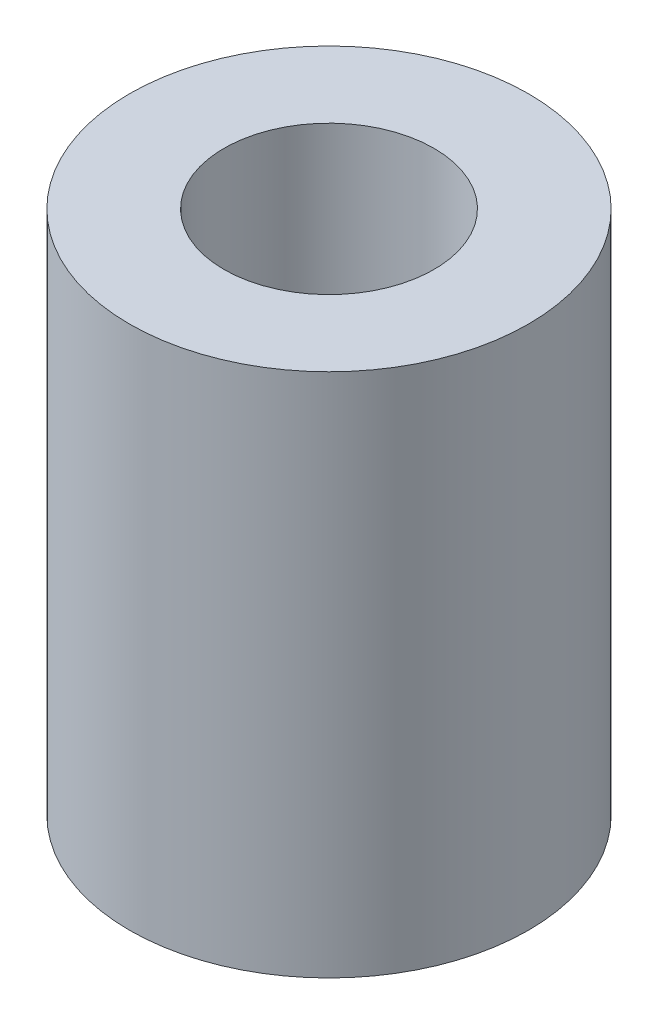
ISO-10303-21;
HEADER;
FILE_DESCRIPTION(('STEP AP214'),'2;1');
FILE_NAME('part.step','',(''),(''),'','','');
FILE_SCHEMA(('AUTOMOTIVE_DESIGN { 1 0 10303 214 1 1 1 1 }'));
ENDSEC;
DATA;
#1=APPLICATION_CONTEXT('core data for automotive mechanical design processes');
#2=APPLICATION_PROTOCOL_DEFINITION('international standard','automotive_design',2000,#1);
#3=PRODUCT_CONTEXT('',#1,'mechanical');
#4=PRODUCT('Part','Part','',(#3));
#5=PRODUCT_RELATED_PRODUCT_CATEGORY('part','',(#4));
#6=PRODUCT_DEFINITION_FORMATION('','',#4);
#7=PRODUCT_DEFINITION_CONTEXT('part definition',#1,'design');
#8=PRODUCT_DEFINITION('design','',#6,#7);
#9=PRODUCT_DEFINITION_SHAPE('','',#8);
#10=(LENGTH_UNIT() NAMED_UNIT(*) SI_UNIT(.MILLI.,.METRE.));
#11=(NAMED_UNIT(*) PLANE_ANGLE_UNIT() SI_UNIT($,.RADIAN.));
#12=(NAMED_UNIT(*) SI_UNIT($,.STERADIAN.) SOLID_ANGLE_UNIT());
#13=UNCERTAINTY_MEASURE_WITH_UNIT(LENGTH_MEASURE(1.E-05),#10,'distance_accuracy_value','');
#14=(GEOMETRIC_REPRESENTATION_CONTEXT(3) GLOBAL_UNCERTAINTY_ASSIGNED_CONTEXT((#13)) GLOBAL_UNIT_ASSIGNED_CONTEXT((#10,
#11,#12)) REPRESENTATION_CONTEXT('',''));
#15=CARTESIAN_POINT('',(0.,0.,0.));
#16=DIRECTION('',(0.,0.,1.));
#17=DIRECTION('',(1.,0.,0.));
#18=AXIS2_PLACEMENT_3D('',#15,#16,#17);
#19=CARTESIAN_POINT('',(0.,25.,0.));
#20=DIRECTION('',(0.,1.,0.));
#21=DIRECTION('',(0.,0.,1.));
#22=AXIS2_PLACEMENT_3D('',#19,#20,#21);
#23=PLANE('',#22);
#24=CARTESIAN_POINT('',(0.,25.,0.));
#25=DIRECTION('',(0.,1.,0.));
#26=DIRECTION('',(0.,0.,1.));
#27=AXIS2_PLACEMENT_3D('',#24,#25,#26);
#28=CIRCLE('',#27,9.5);
#29=CARTESIAN_POINT('',(0.,25.,9.5));
#30=VERTEX_POINT('',#29);
#31=EDGE_CURVE('E10',#30,#30,#28,.T.);
#32=ORIENTED_EDGE('',*,*,#31,.T.);
#33=EDGE_LOOP('',(#32));
#34=FACE_BOUND('',#33,.T.);
#35=CARTESIAN_POINT('',(0.,25.,0.));
#36=DIRECTION('',(0.,1.,0.));
#37=DIRECTION('',(0.,0.,1.));
#38=AXIS2_PLACEMENT_3D('',#35,#36,#37);
#39=CIRCLE('',#38,5.);
#40=CARTESIAN_POINT('',(0.,25.,5.));
#41=VERTEX_POINT('',#40);
#42=EDGE_CURVE('E50',#41,#41,#39,.T.);
#43=ORIENTED_EDGE('',*,*,#42,.F.);
#44=EDGE_LOOP('',(#43));
#45=FACE_BOUND('',#44,.T.);
#46=ADVANCED_FACE('F37',(#34,#45),#23,.T.);
#47=CARTESIAN_POINT('',(0.,0.,0.));
#48=DIRECTION('',(0.,1.,0.));
#49=DIRECTION('',(0.,0.,1.));
#50=AXIS2_PLACEMENT_3D('',#47,#48,#49);
#51=PLANE('',#50);
#52=CARTESIAN_POINT('',(0.,0.,0.));
#53=DIRECTION('',(0.,1.,0.));
#54=DIRECTION('',(0.,0.,1.));
#55=AXIS2_PLACEMENT_3D('',#52,#53,#54);
#56=CIRCLE('',#55,9.5);
#57=CARTESIAN_POINT('',(0.,0.,9.5));
#58=VERTEX_POINT('',#57);
#59=EDGE_CURVE('E41',#58,#58,#56,.T.);
#60=ORIENTED_EDGE('',*,*,#59,.F.);
#61=EDGE_LOOP('',(#60));
#62=FACE_BOUND('',#61,.T.);
#63=CARTESIAN_POINT('',(0.,0.,0.));
#64=DIRECTION('',(0.,1.,0.));
#65=DIRECTION('',(0.,0.,1.));
#66=AXIS2_PLACEMENT_3D('',#63,#64,#65);
#67=CIRCLE('',#66,5.);
#68=CARTESIAN_POINT('',(0.,0.,5.));
#69=VERTEX_POINT('',#68);
#70=EDGE_CURVE('E52',#69,#69,#67,.T.);
#71=ORIENTED_EDGE('',*,*,#70,.T.);
#72=EDGE_LOOP('',(#71));
#73=FACE_BOUND('',#72,.T.);
#74=ADVANCED_FACE('F64',(#62,#73),#51,.F.);
#75=CARTESIAN_POINT('',(0.,25.,0.));
#76=DIRECTION('',(0.,-1.,0.));
#77=DIRECTION('',(0.,0.,-1.));
#78=AXIS2_PLACEMENT_3D('',#75,#76,#77);
#79=CYLINDRICAL_SURFACE('',#78,9.5);
#80=ORIENTED_EDGE('',*,*,#31,.F.);
#81=EDGE_LOOP('',(#80));
#82=FACE_BOUND('',#81,.T.);
#83=ORIENTED_EDGE('',*,*,#59,.T.);
#84=EDGE_LOOP('',(#83));
#85=FACE_BOUND('',#84,.T.);
#86=ADVANCED_FACE('F39',(#82,#85),#79,.T.);
#87=CARTESIAN_POINT('',(0.,25.,0.));
#88=DIRECTION('',(0.,-1.,0.));
#89=DIRECTION('',(0.,0.,-1.));
#90=AXIS2_PLACEMENT_3D('',#87,#88,#89);
#91=CYLINDRICAL_SURFACE('',#90,5.);
#92=ORIENTED_EDGE('',*,*,#42,.T.);
#93=EDGE_LOOP('',(#92));
#94=FACE_BOUND('',#93,.T.);
#95=ORIENTED_EDGE('',*,*,#70,.F.);
#96=EDGE_LOOP('',(#95));
#97=FACE_BOUND('',#96,.T.);
#98=ADVANCED_FACE('F60',(#94,#97),#91,.F.);
#99=CLOSED_SHELL('',(#46,#74,#86,#98));
#100=MANIFOLD_SOLID_BREP('B2',#99);
#101=ADVANCED_BREP_SHAPE_REPRESENTATION('',(#18,#100),#14);
#102=SHAPE_DEFINITION_REPRESENTATION(#9,#101);
ENDSEC;
END-ISO-10303-21;
